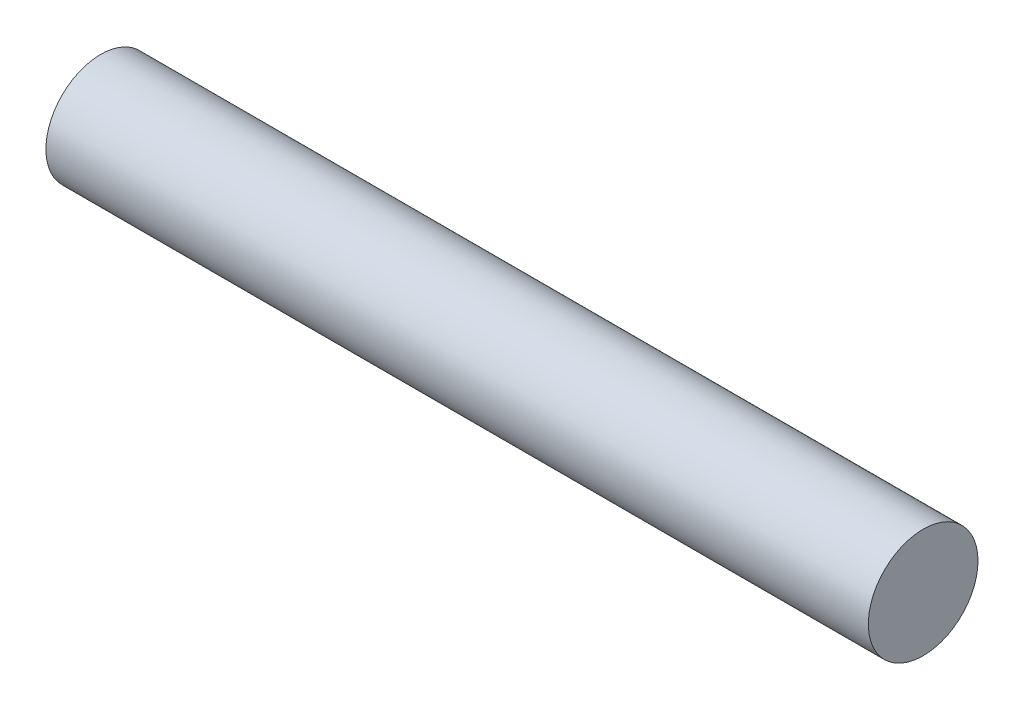
ISO-10303-21;
HEADER;
FILE_DESCRIPTION(('STEP AP214'),'2;1');
FILE_NAME('part.step','',(''),(''),'','','');
FILE_SCHEMA(('AUTOMOTIVE_DESIGN { 1 0 10303 214 1 1 1 1 }'));
ENDSEC;
DATA;
#1=APPLICATION_CONTEXT('core data for automotive mechanical design processes');
#2=APPLICATION_PROTOCOL_DEFINITION('international standard','automotive_design',2000,#1);
#3=PRODUCT_CONTEXT('',#1,'mechanical');
#4=PRODUCT('Part','Part','',(#3));
#5=PRODUCT_RELATED_PRODUCT_CATEGORY('part','',(#4));
#6=PRODUCT_DEFINITION_FORMATION('','',#4);
#7=PRODUCT_DEFINITION_CONTEXT('part definition',#1,'design');
#8=PRODUCT_DEFINITION('design','',#6,#7);
#9=PRODUCT_DEFINITION_SHAPE('','',#8);
#10=(LENGTH_UNIT() NAMED_UNIT(*) SI_UNIT(.MILLI.,.METRE.));
#11=(NAMED_UNIT(*) PLANE_ANGLE_UNIT() SI_UNIT($,.RADIAN.));
#12=(NAMED_UNIT(*) SI_UNIT($,.STERADIAN.) SOLID_ANGLE_UNIT());
#13=UNCERTAINTY_MEASURE_WITH_UNIT(LENGTH_MEASURE(1.E-05),#10,'distance_accuracy_value','');
#14=(GEOMETRIC_REPRESENTATION_CONTEXT(3) GLOBAL_UNCERTAINTY_ASSIGNED_CONTEXT((#13)) GLOBAL_UNIT_ASSIGNED_CONTEXT((#10,
#11,#12)) REPRESENTATION_CONTEXT('',''));
#15=CARTESIAN_POINT('',(0.,0.,0.));
#16=DIRECTION('',(0.,0.,1.));
#17=DIRECTION('',(1.,0.,0.));
#18=AXIS2_PLACEMENT_3D('',#15,#16,#17);
#19=CARTESIAN_POINT('',(19.05,0.,0.));
#20=DIRECTION('',(-1.,0.,0.));
#21=DIRECTION('',(0.,0.,1.));
#22=AXIS2_PLACEMENT_3D('',#19,#20,#21);
#23=CYLINDRICAL_SURFACE('',#22,1.27);
#24=CARTESIAN_POINT('',(19.05,0.,0.));
#25=DIRECTION('',(1.,0.,0.));
#26=DIRECTION('',(0.,0.,-1.));
#27=AXIS2_PLACEMENT_3D('',#24,#25,#26);
#28=CIRCLE('',#27,1.27);
#29=CARTESIAN_POINT('',(19.05,0.,-1.27));
#30=VERTEX_POINT('',#29);
#31=EDGE_CURVE('E10',#30,#30,#28,.T.);
#32=ORIENTED_EDGE('',*,*,#31,.F.);
#33=EDGE_LOOP('',(#32));
#34=FACE_BOUND('',#33,.T.);
#35=CARTESIAN_POINT('',(0.,0.,0.));
#36=DIRECTION('',(1.,0.,0.));
#37=DIRECTION('',(0.,0.,-1.));
#38=AXIS2_PLACEMENT_3D('',#35,#36,#37);
#39=CIRCLE('',#38,1.27);
#40=CARTESIAN_POINT('',(0.,0.,-1.27));
#41=VERTEX_POINT('',#40);
#42=EDGE_CURVE('E40',#41,#41,#39,.T.);
#43=ORIENTED_EDGE('',*,*,#42,.T.);
#44=EDGE_LOOP('',(#43));
#45=FACE_BOUND('',#44,.T.);
#46=ADVANCED_FACE('F37',(#34,#45),#23,.T.);
#47=CARTESIAN_POINT('',(19.05,0.,0.));
#48=DIRECTION('',(1.,0.,0.));
#49=DIRECTION('',(0.,0.,-1.));
#50=AXIS2_PLACEMENT_3D('',#47,#48,#49);
#51=PLANE('',#50);
#52=ORIENTED_EDGE('',*,*,#31,.T.);
#53=EDGE_LOOP('',(#52));
#54=FACE_BOUND('',#53,.T.);
#55=ADVANCED_FACE('F54',(#54),#51,.T.);
#56=CARTESIAN_POINT('',(0.,0.,0.));
#57=DIRECTION('',(1.,0.,0.));
#58=DIRECTION('',(0.,0.,-1.));
#59=AXIS2_PLACEMENT_3D('',#56,#57,#58);
#60=PLANE('',#59);
#61=ORIENTED_EDGE('',*,*,#42,.F.);
#62=EDGE_LOOP('',(#61));
#63=FACE_BOUND('',#62,.T.);
#64=ADVANCED_FACE('F52',(#63),#60,.F.);
#65=CLOSED_SHELL('',(#46,#55,#64));
#66=MANIFOLD_SOLID_BREP('B2',#65);
#67=ADVANCED_BREP_SHAPE_REPRESENTATION('',(#18,#66),#14);
#68=SHAPE_DEFINITION_REPRESENTATION(#9,#67);
ENDSEC;
END-ISO-10303-21;
